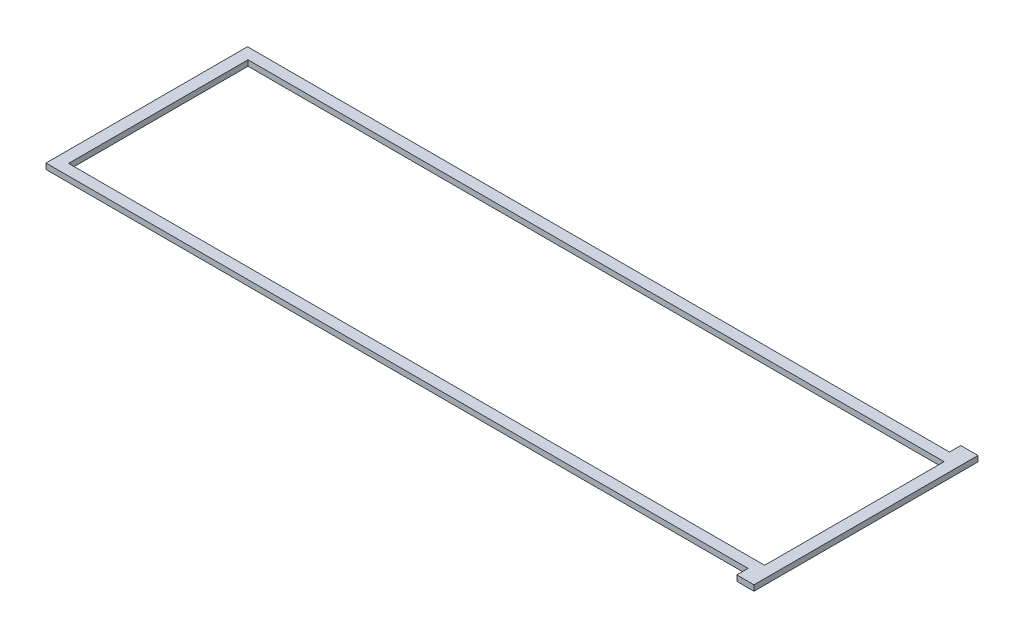
ISO-10303-21;
HEADER;
FILE_DESCRIPTION(('STEP AP214'),'2;1');
FILE_NAME('part.step','',(''),(''),'','','');
FILE_SCHEMA(('AUTOMOTIVE_DESIGN { 1 0 10303 214 1 1 1 1 }'));
ENDSEC;
DATA;
#1=APPLICATION_CONTEXT('core data for automotive mechanical design processes');
#2=APPLICATION_PROTOCOL_DEFINITION('international standard','automotive_design',2000,#1);
#3=PRODUCT_CONTEXT('',#1,'mechanical');
#4=PRODUCT('Part','Part','',(#3));
#5=PRODUCT_RELATED_PRODUCT_CATEGORY('part','',(#4));
#6=PRODUCT_DEFINITION_FORMATION('','',#4);
#7=PRODUCT_DEFINITION_CONTEXT('part definition',#1,'design');
#8=PRODUCT_DEFINITION('design','',#6,#7);
#9=PRODUCT_DEFINITION_SHAPE('','',#8);
#10=(LENGTH_UNIT() NAMED_UNIT(*) SI_UNIT(.MILLI.,.METRE.));
#11=(NAMED_UNIT(*) PLANE_ANGLE_UNIT() SI_UNIT($,.RADIAN.));
#12=(NAMED_UNIT(*) SI_UNIT($,.STERADIAN.) SOLID_ANGLE_UNIT());
#13=UNCERTAINTY_MEASURE_WITH_UNIT(LENGTH_MEASURE(1.E-05),#10,'distance_accuracy_value','');
#14=(GEOMETRIC_REPRESENTATION_CONTEXT(3) GLOBAL_UNCERTAINTY_ASSIGNED_CONTEXT((#13)) GLOBAL_UNIT_ASSIGNED_CONTEXT((#10,
#11,#12)) REPRESENTATION_CONTEXT('',''));
#15=CARTESIAN_POINT('',(0.,0.,0.));
#16=DIRECTION('',(0.,0.,1.));
#17=DIRECTION('',(1.,0.,0.));
#18=AXIS2_PLACEMENT_3D('',#15,#16,#17);
#19=CARTESIAN_POINT('',(-196.7484,0.,50.7492));
#20=DIRECTION('',(0.,0.,1.));
#21=DIRECTION('',(1.,0.,0.));
#22=AXIS2_PLACEMENT_3D('',#19,#20,#21);
#23=PLANE('',#22);
#24=DIRECTION('',(1.,0.,0.));
#25=VECTOR('',#24,1.);
#26=CARTESIAN_POINT('',(-196.7484,3.175,50.7492));
#27=LINE('',#26,#25);
#28=CARTESIAN_POINT('',(-196.7484,3.175,50.7492));
#29=VERTEX_POINT('',#28);
#30=CARTESIAN_POINT('',(196.7484,3.175,50.7492));
#31=VERTEX_POINT('',#30);
#32=EDGE_CURVE('E70',#29,#31,#27,.T.);
#33=ORIENTED_EDGE('',*,*,#32,.T.);
#34=DIRECTION('',(0.,1.,0.));
#35=VECTOR('',#34,1.);
#36=CARTESIAN_POINT('',(196.7484,0.,50.7492));
#37=LINE('',#36,#35);
#38=CARTESIAN_POINT('',(196.7484,0.,50.7492));
#39=VERTEX_POINT('',#38);
#40=EDGE_CURVE('E133',#39,#31,#37,.T.);
#41=ORIENTED_EDGE('',*,*,#40,.F.);
#42=DIRECTION('',(1.,0.,0.));
#43=VECTOR('',#42,1.);
#44=CARTESIAN_POINT('',(-196.7484,0.,50.7492));
#45=LINE('',#44,#43);
#46=CARTESIAN_POINT('',(-196.7484,0.,50.7492));
#47=VERTEX_POINT('',#46);
#48=EDGE_CURVE('E136',#47,#39,#45,.T.);
#49=ORIENTED_EDGE('',*,*,#48,.F.);
#50=DIRECTION('',(0.,1.,0.));
#51=VECTOR('',#50,1.);
#52=CARTESIAN_POINT('',(-196.7484,0.,50.7492));
#53=LINE('',#52,#51);
#54=EDGE_CURVE('E175',#47,#29,#53,.T.);
#55=ORIENTED_EDGE('',*,*,#54,.T.);
#56=EDGE_LOOP('',(#33,#41,#49,#55));
#57=FACE_BOUND('',#56,.T.);
#58=ADVANCED_FACE('F44',(#57),#23,.F.);
#59=CARTESIAN_POINT('',(-196.7484,0.,-50.6984));
#60=DIRECTION('',(-1.,0.,0.));
#61=DIRECTION('',(0.,0.,1.));
#62=AXIS2_PLACEMENT_3D('',#59,#60,#61);
#63=PLANE('',#62);
#64=DIRECTION('',(0.,0.,1.));
#65=VECTOR('',#64,1.);
#66=CARTESIAN_POINT('',(-196.7484,3.175,-50.6984));
#67=LINE('',#66,#65);
#68=CARTESIAN_POINT('',(-196.7484,3.175,-50.6984));
#69=VERTEX_POINT('',#68);
#70=EDGE_CURVE('E153',#69,#29,#67,.T.);
#71=ORIENTED_EDGE('',*,*,#70,.T.);
#72=ORIENTED_EDGE('',*,*,#54,.F.);
#73=DIRECTION('',(0.,0.,1.));
#74=VECTOR('',#73,1.);
#75=CARTESIAN_POINT('',(-196.7484,0.,-50.6984));
#76=LINE('',#75,#74);
#77=CARTESIAN_POINT('',(-196.7484,0.,-50.6984));
#78=VERTEX_POINT('',#77);
#79=EDGE_CURVE('E143',#78,#47,#76,.T.);
#80=ORIENTED_EDGE('',*,*,#79,.F.);
#81=DIRECTION('',(0.,1.,0.));
#82=VECTOR('',#81,1.);
#83=CARTESIAN_POINT('',(-196.7484,0.,-50.6984));
#84=LINE('',#83,#82);
#85=EDGE_CURVE('E179',#78,#69,#84,.T.);
#86=ORIENTED_EDGE('',*,*,#85,.T.);
#87=EDGE_LOOP('',(#71,#72,#80,#86));
#88=FACE_BOUND('',#87,.T.);
#89=ADVANCED_FACE('F323',(#88),#63,.F.);
#90=CARTESIAN_POINT('',(196.7484,0.,-50.6984));
#91=DIRECTION('',(0.,0.,-1.));
#92=DIRECTION('',(-1.,0.,0.));
#93=AXIS2_PLACEMENT_3D('',#90,#91,#92);
#94=PLANE('',#93);
#95=DIRECTION('',(-1.,0.,0.));
#96=VECTOR('',#95,1.);
#97=CARTESIAN_POINT('',(196.7484,3.175,-50.6984));
#98=LINE('',#97,#96);
#99=CARTESIAN_POINT('',(196.7484,3.175,-50.6984));
#100=VERTEX_POINT('',#99);
#101=EDGE_CURVE('E157',#100,#69,#98,.T.);
#102=ORIENTED_EDGE('',*,*,#101,.T.);
#103=ORIENTED_EDGE('',*,*,#85,.F.);
#104=DIRECTION('',(-1.,0.,0.));
#105=VECTOR('',#104,1.);
#106=CARTESIAN_POINT('',(196.7484,0.,-50.6984));
#107=LINE('',#106,#105);
#108=CARTESIAN_POINT('',(196.7484,0.,-50.6984));
#109=VERTEX_POINT('',#108);
#110=EDGE_CURVE('E62',#109,#78,#107,.T.);
#111=ORIENTED_EDGE('',*,*,#110,.F.);
#112=DIRECTION('',(0.,1.,0.));
#113=VECTOR('',#112,1.);
#114=CARTESIAN_POINT('',(196.7484,0.,-50.6984));
#115=LINE('',#114,#113);
#116=EDGE_CURVE('E142',#109,#100,#115,.T.);
#117=ORIENTED_EDGE('',*,*,#116,.T.);
#118=EDGE_LOOP('',(#102,#103,#111,#117));
#119=FACE_BOUND('',#118,.T.);
#120=ADVANCED_FACE('F328',(#119),#94,.F.);
#121=CARTESIAN_POINT('',(196.7484,0.,50.7492));
#122=DIRECTION('',(1.,0.,0.));
#123=DIRECTION('',(0.,0.,-1.));
#124=AXIS2_PLACEMENT_3D('',#121,#122,#123);
#125=PLANE('',#124);
#126=DIRECTION('',(0.,0.,-1.));
#127=VECTOR('',#126,1.);
#128=CARTESIAN_POINT('',(196.7484,3.175,50.7492));
#129=LINE('',#128,#127);
#130=EDGE_CURVE('E167',#31,#100,#129,.T.);
#131=ORIENTED_EDGE('',*,*,#130,.T.);
#132=ORIENTED_EDGE('',*,*,#116,.F.);
#133=DIRECTION('',(0.,0.,-1.));
#134=VECTOR('',#133,1.);
#135=CARTESIAN_POINT('',(196.7484,0.,50.7492));
#136=LINE('',#135,#134);
#137=EDGE_CURVE('E146',#39,#109,#136,.T.);
#138=ORIENTED_EDGE('',*,*,#137,.F.);
#139=ORIENTED_EDGE('',*,*,#40,.T.);
#140=EDGE_LOOP('',(#131,#132,#138,#139));
#141=FACE_BOUND('',#140,.T.);
#142=ADVANCED_FACE('F147',(#141),#125,.F.);
#143=CARTESIAN_POINT('',(0.,3.175,0.));
#144=DIRECTION('',(0.,1.,0.));
#145=DIRECTION('',(0.,0.,1.));
#146=AXIS2_PLACEMENT_3D('',#143,#144,#145);
#147=PLANE('',#146);
#148=DIRECTION('',(1.,0.,0.));
#149=VECTOR('',#148,1.);
#150=CARTESIAN_POINT('',(-203.3016,3.175,56.949975));
#151=LINE('',#150,#149);
#152=CARTESIAN_POINT('',(-203.3016,3.175,56.949975));
#153=VERTEX_POINT('',#152);
#154=CARTESIAN_POINT('',(193.5734,3.175,56.949975));
#155=VERTEX_POINT('',#154);
#156=EDGE_CURVE('E178',#153,#155,#151,.T.);
#157=ORIENTED_EDGE('',*,*,#156,.T.);
#158=DIRECTION('',(0.,0.,1.));
#159=VECTOR('',#158,1.);
#160=CARTESIAN_POINT('',(193.5734,3.175,56.949975));
#161=LINE('',#160,#159);
#162=CARTESIAN_POINT('',(193.5734,3.175,63.325375));
#163=VERTEX_POINT('',#162);
#164=EDGE_CURVE('E221',#155,#163,#161,.T.);
#165=ORIENTED_EDGE('',*,*,#164,.T.);
#166=DIRECTION('',(1.,0.,0.));
#167=VECTOR('',#166,1.);
#168=CARTESIAN_POINT('',(193.5734,3.175,63.325375));
#169=LINE('',#168,#167);
#170=CARTESIAN_POINT('',(203.3016,3.175,63.325375));
#171=VERTEX_POINT('',#170);
#172=EDGE_CURVE('E230',#163,#171,#169,.T.);
#173=ORIENTED_EDGE('',*,*,#172,.T.);
#174=DIRECTION('',(0.,0.,-1.));
#175=VECTOR('',#174,1.);
#176=CARTESIAN_POINT('',(203.3016,3.175,63.325375));
#177=LINE('',#176,#175);
#178=CARTESIAN_POINT('',(203.3016,3.175,-63.325375));
#179=VERTEX_POINT('',#178);
#180=EDGE_CURVE('E234',#171,#179,#177,.T.);
#181=ORIENTED_EDGE('',*,*,#180,.T.);
#182=DIRECTION('',(-1.,0.,0.));
#183=VECTOR('',#182,1.);
#184=CARTESIAN_POINT('',(203.3016,3.175,-63.325375));
#185=LINE('',#184,#183);
#186=CARTESIAN_POINT('',(193.5734,3.175,-63.325375));
#187=VERTEX_POINT('',#186);
#188=EDGE_CURVE('E239',#179,#187,#185,.T.);
#189=ORIENTED_EDGE('',*,*,#188,.T.);
#190=DIRECTION('',(0.,0.,1.));
#191=VECTOR('',#190,1.);
#192=CARTESIAN_POINT('',(193.5734,3.175,-63.325375));
#193=LINE('',#192,#191);
#194=CARTESIAN_POINT('',(193.5734,3.175,-56.949975));
#195=VERTEX_POINT('',#194);
#196=EDGE_CURVE('E244',#187,#195,#193,.T.);
#197=ORIENTED_EDGE('',*,*,#196,.T.);
#198=DIRECTION('',(-1.,0.,0.));
#199=VECTOR('',#198,1.);
#200=CARTESIAN_POINT('',(193.5734,3.175,-56.949975));
#201=LINE('',#200,#199);
#202=CARTESIAN_POINT('',(-203.3016,3.175,-56.949975));
#203=VERTEX_POINT('',#202);
#204=EDGE_CURVE('E250',#195,#203,#201,.T.);
#205=ORIENTED_EDGE('',*,*,#204,.T.);
#206=DIRECTION('',(0.,0.,1.));
#207=VECTOR('',#206,1.);
#208=CARTESIAN_POINT('',(-203.3016,3.175,-56.949975));
#209=LINE('',#208,#207);
#210=EDGE_CURVE('E189',#203,#153,#209,.T.);
#211=ORIENTED_EDGE('',*,*,#210,.T.);
#212=EDGE_LOOP('',(#157,#165,#173,#181,#189,#197,#205,#211));
#213=FACE_BOUND('',#212,.T.);
#214=ORIENTED_EDGE('',*,*,#130,.F.);
#215=ORIENTED_EDGE('',*,*,#32,.F.);
#216=ORIENTED_EDGE('',*,*,#70,.F.);
#217=ORIENTED_EDGE('',*,*,#101,.F.);
#218=EDGE_LOOP('',(#214,#215,#216,#217));
#219=FACE_BOUND('',#218,.T.);
#220=ADVANCED_FACE('F286',(#213,#219),#147,.T.);
#221=CARTESIAN_POINT('',(-203.3016,0.,-56.949975));
#222=DIRECTION('',(-1.,0.,0.));
#223=DIRECTION('',(0.,0.,1.));
#224=AXIS2_PLACEMENT_3D('',#221,#222,#223);
#225=PLANE('',#224);
#226=ORIENTED_EDGE('',*,*,#210,.F.);
#227=DIRECTION('',(0.,1.,0.));
#228=VECTOR('',#227,1.);
#229=CARTESIAN_POINT('',(-203.3016,0.,-56.949975));
#230=LINE('',#229,#228);
#231=CARTESIAN_POINT('',(-203.3016,0.,-56.949975));
#232=VERTEX_POINT('',#231);
#233=EDGE_CURVE('E54',#232,#203,#230,.T.);
#234=ORIENTED_EDGE('',*,*,#233,.F.);
#235=DIRECTION('',(0.,0.,1.));
#236=VECTOR('',#235,1.);
#237=CARTESIAN_POINT('',(-203.3016,0.,-56.949975));
#238=LINE('',#237,#236);
#239=CARTESIAN_POINT('',(-203.3016,0.,56.949975));
#240=VERTEX_POINT('',#239);
#241=EDGE_CURVE('E213',#232,#240,#238,.T.);
#242=ORIENTED_EDGE('',*,*,#241,.T.);
#243=DIRECTION('',(0.,1.,0.));
#244=VECTOR('',#243,1.);
#245=CARTESIAN_POINT('',(-203.3016,0.,56.949975));
#246=LINE('',#245,#244);
#247=EDGE_CURVE('E12',#240,#153,#246,.T.);
#248=ORIENTED_EDGE('',*,*,#247,.T.);
#249=EDGE_LOOP('',(#226,#234,#242,#248));
#250=FACE_BOUND('',#249,.T.);
#251=ADVANCED_FACE('F292',(#250),#225,.T.);
#252=CARTESIAN_POINT('',(193.5734,0.,-56.949975));
#253=DIRECTION('',(0.,0.,-1.));
#254=DIRECTION('',(-1.,0.,0.));
#255=AXIS2_PLACEMENT_3D('',#252,#253,#254);
#256=PLANE('',#255);
#257=ORIENTED_EDGE('',*,*,#204,.F.);
#258=DIRECTION('',(0.,1.,0.));
#259=VECTOR('',#258,1.);
#260=CARTESIAN_POINT('',(193.5734,0.,-56.949975));
#261=LINE('',#260,#259);
#262=CARTESIAN_POINT('',(193.5734,0.,-56.949975));
#263=VERTEX_POINT('',#262);
#264=EDGE_CURVE('E260',#263,#195,#261,.T.);
#265=ORIENTED_EDGE('',*,*,#264,.F.);
#266=DIRECTION('',(-1.,0.,0.));
#267=VECTOR('',#266,1.);
#268=CARTESIAN_POINT('',(193.5734,0.,-56.949975));
#269=LINE('',#268,#267);
#270=EDGE_CURVE('E209',#263,#232,#269,.T.);
#271=ORIENTED_EDGE('',*,*,#270,.T.);
#272=ORIENTED_EDGE('',*,*,#233,.T.);
#273=EDGE_LOOP('',(#257,#265,#271,#272));
#274=FACE_BOUND('',#273,.T.);
#275=ADVANCED_FACE('F313',(#274),#256,.T.);
#276=CARTESIAN_POINT('',(193.5734,0.,-63.325375));
#277=DIRECTION('',(-1.,0.,0.));
#278=DIRECTION('',(0.,0.,1.));
#279=AXIS2_PLACEMENT_3D('',#276,#277,#278);
#280=PLANE('',#279);
#281=ORIENTED_EDGE('',*,*,#196,.F.);
#282=DIRECTION('',(0.,1.,0.));
#283=VECTOR('',#282,1.);
#284=CARTESIAN_POINT('',(193.5734,0.,-63.325375));
#285=LINE('',#284,#283);
#286=CARTESIAN_POINT('',(193.5734,0.,-63.325375));
#287=VERTEX_POINT('',#286);
#288=EDGE_CURVE('E263',#287,#187,#285,.T.);
#289=ORIENTED_EDGE('',*,*,#288,.F.);
#290=DIRECTION('',(0.,0.,1.));
#291=VECTOR('',#290,1.);
#292=CARTESIAN_POINT('',(193.5734,0.,-63.325375));
#293=LINE('',#292,#291);
#294=EDGE_CURVE('E205',#287,#263,#293,.T.);
#295=ORIENTED_EDGE('',*,*,#294,.T.);
#296=ORIENTED_EDGE('',*,*,#264,.T.);
#297=EDGE_LOOP('',(#281,#289,#295,#296));
#298=FACE_BOUND('',#297,.T.);
#299=ADVANCED_FACE('F310',(#298),#280,.T.);
#300=CARTESIAN_POINT('',(203.3016,0.,-63.325375));
#301=DIRECTION('',(0.,0.,-1.));
#302=DIRECTION('',(-1.,0.,0.));
#303=AXIS2_PLACEMENT_3D('',#300,#301,#302);
#304=PLANE('',#303);
#305=ORIENTED_EDGE('',*,*,#188,.F.);
#306=DIRECTION('',(0.,1.,0.));
#307=VECTOR('',#306,1.);
#308=CARTESIAN_POINT('',(203.3016,0.,-63.325375));
#309=LINE('',#308,#307);
#310=CARTESIAN_POINT('',(203.3016,0.,-63.325375));
#311=VERTEX_POINT('',#310);
#312=EDGE_CURVE('E266',#311,#179,#309,.T.);
#313=ORIENTED_EDGE('',*,*,#312,.F.);
#314=DIRECTION('',(-1.,0.,0.));
#315=VECTOR('',#314,1.);
#316=CARTESIAN_POINT('',(203.3016,0.,-63.325375));
#317=LINE('',#316,#315);
#318=EDGE_CURVE('E201',#311,#287,#317,.T.);
#319=ORIENTED_EDGE('',*,*,#318,.T.);
#320=ORIENTED_EDGE('',*,*,#288,.T.);
#321=EDGE_LOOP('',(#305,#313,#319,#320));
#322=FACE_BOUND('',#321,.T.);
#323=ADVANCED_FACE('F306',(#322),#304,.T.);
#324=CARTESIAN_POINT('',(203.3016,0.,63.325375));
#325=DIRECTION('',(1.,0.,0.));
#326=DIRECTION('',(0.,0.,-1.));
#327=AXIS2_PLACEMENT_3D('',#324,#325,#326);
#328=PLANE('',#327);
#329=ORIENTED_EDGE('',*,*,#180,.F.);
#330=DIRECTION('',(0.,1.,0.));
#331=VECTOR('',#330,1.);
#332=CARTESIAN_POINT('',(203.3016,0.,63.325375));
#333=LINE('',#332,#331);
#334=CARTESIAN_POINT('',(203.3016,0.,63.325375));
#335=VERTEX_POINT('',#334);
#336=EDGE_CURVE('E269',#335,#171,#333,.T.);
#337=ORIENTED_EDGE('',*,*,#336,.F.);
#338=DIRECTION('',(0.,0.,-1.));
#339=VECTOR('',#338,1.);
#340=CARTESIAN_POINT('',(203.3016,0.,63.325375));
#341=LINE('',#340,#339);
#342=EDGE_CURVE('E197',#335,#311,#341,.T.);
#343=ORIENTED_EDGE('',*,*,#342,.T.);
#344=ORIENTED_EDGE('',*,*,#312,.T.);
#345=EDGE_LOOP('',(#329,#337,#343,#344));
#346=FACE_BOUND('',#345,.T.);
#347=ADVANCED_FACE('F304',(#346),#328,.T.);
#348=CARTESIAN_POINT('',(193.5734,0.,63.325375));
#349=DIRECTION('',(0.,0.,1.));
#350=DIRECTION('',(1.,0.,0.));
#351=AXIS2_PLACEMENT_3D('',#348,#349,#350);
#352=PLANE('',#351);
#353=ORIENTED_EDGE('',*,*,#172,.F.);
#354=DIRECTION('',(0.,1.,0.));
#355=VECTOR('',#354,1.);
#356=CARTESIAN_POINT('',(193.5734,0.,63.325375));
#357=LINE('',#356,#355);
#358=CARTESIAN_POINT('',(193.5734,0.,63.325375));
#359=VERTEX_POINT('',#358);
#360=EDGE_CURVE('E271',#359,#163,#357,.T.);
#361=ORIENTED_EDGE('',*,*,#360,.F.);
#362=DIRECTION('',(1.,0.,0.));
#363=VECTOR('',#362,1.);
#364=CARTESIAN_POINT('',(193.5734,0.,63.325375));
#365=LINE('',#364,#363);
#366=EDGE_CURVE('E193',#359,#335,#365,.T.);
#367=ORIENTED_EDGE('',*,*,#366,.T.);
#368=ORIENTED_EDGE('',*,*,#336,.T.);
#369=EDGE_LOOP('',(#353,#361,#367,#368));
#370=FACE_BOUND('',#369,.T.);
#371=ADVANCED_FACE('F300',(#370),#352,.T.);
#372=CARTESIAN_POINT('',(193.5734,0.,56.949975));
#373=DIRECTION('',(-1.,0.,0.));
#374=DIRECTION('',(0.,0.,1.));
#375=AXIS2_PLACEMENT_3D('',#372,#373,#374);
#376=PLANE('',#375);
#377=ORIENTED_EDGE('',*,*,#164,.F.);
#378=DIRECTION('',(0.,1.,0.));
#379=VECTOR('',#378,1.);
#380=CARTESIAN_POINT('',(193.5734,0.,56.949975));
#381=LINE('',#380,#379);
#382=CARTESIAN_POINT('',(193.5734,0.,56.949975));
#383=VERTEX_POINT('',#382);
#384=EDGE_CURVE('E48',#383,#155,#381,.T.);
#385=ORIENTED_EDGE('',*,*,#384,.F.);
#386=DIRECTION('',(0.,0.,1.));
#387=VECTOR('',#386,1.);
#388=CARTESIAN_POINT('',(193.5734,0.,56.949975));
#389=LINE('',#388,#387);
#390=EDGE_CURVE('E188',#383,#359,#389,.T.);
#391=ORIENTED_EDGE('',*,*,#390,.T.);
#392=ORIENTED_EDGE('',*,*,#360,.T.);
#393=EDGE_LOOP('',(#377,#385,#391,#392));
#394=FACE_BOUND('',#393,.T.);
#395=ADVANCED_FACE('F283',(#394),#376,.T.);
#396=CARTESIAN_POINT('',(-203.3016,0.,56.949975));
#397=DIRECTION('',(0.,0.,1.));
#398=DIRECTION('',(1.,0.,0.));
#399=AXIS2_PLACEMENT_3D('',#396,#397,#398);
#400=PLANE('',#399);
#401=ORIENTED_EDGE('',*,*,#156,.F.);
#402=ORIENTED_EDGE('',*,*,#247,.F.);
#403=DIRECTION('',(1.,0.,0.));
#404=VECTOR('',#403,1.);
#405=CARTESIAN_POINT('',(-203.3016,0.,56.949975));
#406=LINE('',#405,#404);
#407=EDGE_CURVE('E184',#240,#383,#406,.T.);
#408=ORIENTED_EDGE('',*,*,#407,.T.);
#409=ORIENTED_EDGE('',*,*,#384,.T.);
#410=EDGE_LOOP('',(#401,#402,#408,#409));
#411=FACE_BOUND('',#410,.T.);
#412=ADVANCED_FACE('F279',(#411),#400,.T.);
#413=CARTESIAN_POINT('',(0.,0.,0.));
#414=DIRECTION('',(0.,1.,0.));
#415=DIRECTION('',(0.,0.,1.));
#416=AXIS2_PLACEMENT_3D('',#413,#414,#415);
#417=PLANE('',#416);
#418=ORIENTED_EDGE('',*,*,#407,.F.);
#419=ORIENTED_EDGE('',*,*,#241,.F.);
#420=ORIENTED_EDGE('',*,*,#270,.F.);
#421=ORIENTED_EDGE('',*,*,#294,.F.);
#422=ORIENTED_EDGE('',*,*,#318,.F.);
#423=ORIENTED_EDGE('',*,*,#342,.F.);
#424=ORIENTED_EDGE('',*,*,#366,.F.);
#425=ORIENTED_EDGE('',*,*,#390,.F.);
#426=EDGE_LOOP('',(#418,#419,#420,#421,#422,#423,#424,#425));
#427=FACE_BOUND('',#426,.T.);
#428=ORIENTED_EDGE('',*,*,#48,.T.);
#429=ORIENTED_EDGE('',*,*,#137,.T.);
#430=ORIENTED_EDGE('',*,*,#110,.T.);
#431=ORIENTED_EDGE('',*,*,#79,.T.);
#432=EDGE_LOOP('',(#428,#429,#430,#431));
#433=FACE_BOUND('',#432,.T.);
#434=ADVANCED_FACE('F46',(#427,#433),#417,.F.);
#435=CLOSED_SHELL('',(#58,#89,#120,#142,#220,#251,#275,#299,#323,#347,#371,#395,#412,#434));
#436=MANIFOLD_SOLID_BREP('B2',#435);
#437=ADVANCED_BREP_SHAPE_REPRESENTATION('',(#18,#436),#14);
#438=SHAPE_DEFINITION_REPRESENTATION(#9,#437);
ENDSEC;
END-ISO-10303-21;
